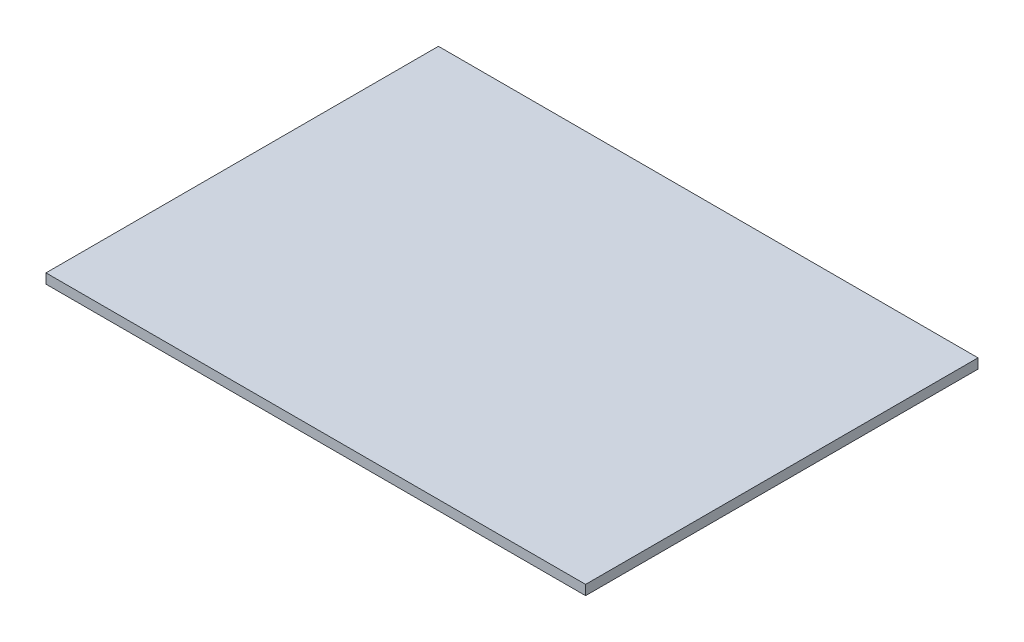
ISO-10303-21;
HEADER;
FILE_DESCRIPTION(('STEP AP214'),'2;1');
FILE_NAME('part.step','',(''),(''),'','','');
FILE_SCHEMA(('AUTOMOTIVE_DESIGN { 1 0 10303 214 1 1 1 1 }'));
ENDSEC;
DATA;
#1=APPLICATION_CONTEXT('core data for automotive mechanical design processes');
#2=APPLICATION_PROTOCOL_DEFINITION('international standard','automotive_design',2000,#1);
#3=PRODUCT_CONTEXT('',#1,'mechanical');
#4=PRODUCT('Part','Part','',(#3));
#5=PRODUCT_RELATED_PRODUCT_CATEGORY('part','',(#4));
#6=PRODUCT_DEFINITION_FORMATION('','',#4);
#7=PRODUCT_DEFINITION_CONTEXT('part definition',#1,'design');
#8=PRODUCT_DEFINITION('design','',#6,#7);
#9=PRODUCT_DEFINITION_SHAPE('','',#8);
#10=(LENGTH_UNIT() NAMED_UNIT(*) SI_UNIT(.MILLI.,.METRE.));
#11=(NAMED_UNIT(*) PLANE_ANGLE_UNIT() SI_UNIT($,.RADIAN.));
#12=(NAMED_UNIT(*) SI_UNIT($,.STERADIAN.) SOLID_ANGLE_UNIT());
#13=UNCERTAINTY_MEASURE_WITH_UNIT(LENGTH_MEASURE(1.E-05),#10,'distance_accuracy_value','');
#14=(GEOMETRIC_REPRESENTATION_CONTEXT(3) GLOBAL_UNCERTAINTY_ASSIGNED_CONTEXT((#13)) GLOBAL_UNIT_ASSIGNED_CONTEXT((#10,
#11,#12)) REPRESENTATION_CONTEXT('',''));
#15=CARTESIAN_POINT('',(0.,0.,0.));
#16=DIRECTION('',(0.,0.,1.));
#17=DIRECTION('',(1.,0.,0.));
#18=AXIS2_PLACEMENT_3D('',#15,#16,#17);
#19=CARTESIAN_POINT('',(0.,100.,0.));
#20=DIRECTION('',(1.,0.,0.));
#21=DIRECTION('',(0.,0.,-1.));
#22=AXIS2_PLACEMENT_3D('',#19,#20,#21);
#23=PLANE('',#22);
#24=DIRECTION('',(0.,0.,1.));
#25=VECTOR('',#24,1.);
#26=CARTESIAN_POINT('',(0.,0.,0.));
#27=LINE('',#26,#25);
#28=CARTESIAN_POINT('',(0.,0.,-4000.));
#29=VERTEX_POINT('',#28);
#30=CARTESIAN_POINT('',(0.,0.,0.));
#31=VERTEX_POINT('',#30);
#32=EDGE_CURVE('E100',#29,#31,#27,.T.);
#33=ORIENTED_EDGE('',*,*,#32,.T.);
#34=DIRECTION('',(0.,-1.,0.));
#35=VECTOR('',#34,1.);
#36=CARTESIAN_POINT('',(0.,100.,0.));
#37=LINE('',#36,#35);
#38=CARTESIAN_POINT('',(0.,100.,0.));
#39=VERTEX_POINT('',#38);
#40=EDGE_CURVE('E11',#39,#31,#37,.T.);
#41=ORIENTED_EDGE('',*,*,#40,.F.);
#42=DIRECTION('',(0.,0.,1.));
#43=VECTOR('',#42,1.);
#44=CARTESIAN_POINT('',(0.,100.,0.));
#45=LINE('',#44,#43);
#46=CARTESIAN_POINT('',(0.,100.,-4000.));
#47=VERTEX_POINT('',#46);
#48=EDGE_CURVE('E88',#47,#39,#45,.T.);
#49=ORIENTED_EDGE('',*,*,#48,.F.);
#50=DIRECTION('',(0.,-1.,0.));
#51=VECTOR('',#50,1.);
#52=CARTESIAN_POINT('',(0.,100.,-4000.));
#53=LINE('',#52,#51);
#54=EDGE_CURVE('E96',#47,#29,#53,.T.);
#55=ORIENTED_EDGE('',*,*,#54,.T.);
#56=EDGE_LOOP('',(#33,#41,#49,#55));
#57=FACE_BOUND('',#56,.T.);
#58=ADVANCED_FACE('F37',(#57),#23,.F.);
#59=CARTESIAN_POINT('',(0.,100.,0.));
#60=DIRECTION('',(0.,0.,-1.));
#61=DIRECTION('',(-1.,0.,0.));
#62=AXIS2_PLACEMENT_3D('',#59,#60,#61);
#63=PLANE('',#62);
#64=DIRECTION('',(1.,0.,0.));
#65=VECTOR('',#64,1.);
#66=CARTESIAN_POINT('',(0.,0.,0.));
#67=LINE('',#66,#65);
#68=CARTESIAN_POINT('',(5500.,0.,0.));
#69=VERTEX_POINT('',#68);
#70=EDGE_CURVE('E92',#31,#69,#67,.T.);
#71=ORIENTED_EDGE('',*,*,#70,.T.);
#72=DIRECTION('',(0.,-1.,0.));
#73=VECTOR('',#72,1.);
#74=CARTESIAN_POINT('',(5500.,100.,0.));
#75=LINE('',#74,#73);
#76=CARTESIAN_POINT('',(5500.,100.,0.));
#77=VERTEX_POINT('',#76);
#78=EDGE_CURVE('E45',#77,#69,#75,.T.);
#79=ORIENTED_EDGE('',*,*,#78,.F.);
#80=DIRECTION('',(1.,0.,0.));
#81=VECTOR('',#80,1.);
#82=CARTESIAN_POINT('',(0.,100.,0.));
#83=LINE('',#82,#81);
#84=EDGE_CURVE('E83',#39,#77,#83,.T.);
#85=ORIENTED_EDGE('',*,*,#84,.F.);
#86=ORIENTED_EDGE('',*,*,#40,.T.);
#87=EDGE_LOOP('',(#71,#79,#85,#86));
#88=FACE_BOUND('',#87,.T.);
#89=ADVANCED_FACE('F91',(#88),#63,.F.);
#90=CARTESIAN_POINT('',(5500.,100.,0.));
#91=DIRECTION('',(-1.,0.,0.));
#92=DIRECTION('',(0.,0.,1.));
#93=AXIS2_PLACEMENT_3D('',#90,#91,#92);
#94=PLANE('',#93);
#95=DIRECTION('',(0.,0.,-1.));
#96=VECTOR('',#95,1.);
#97=CARTESIAN_POINT('',(5500.,0.,0.));
#98=LINE('',#97,#96);
#99=CARTESIAN_POINT('',(5500.,0.,-4000.));
#100=VERTEX_POINT('',#99);
#101=EDGE_CURVE('E70',#69,#100,#98,.T.);
#102=ORIENTED_EDGE('',*,*,#101,.T.);
#103=DIRECTION('',(0.,-1.,0.));
#104=VECTOR('',#103,1.);
#105=CARTESIAN_POINT('',(5500.,100.,-4000.));
#106=LINE('',#105,#104);
#107=CARTESIAN_POINT('',(5500.,100.,-4000.));
#108=VERTEX_POINT('',#107);
#109=EDGE_CURVE('E93',#108,#100,#106,.T.);
#110=ORIENTED_EDGE('',*,*,#109,.F.);
#111=DIRECTION('',(0.,0.,-1.));
#112=VECTOR('',#111,1.);
#113=CARTESIAN_POINT('',(5500.,100.,0.));
#114=LINE('',#113,#112);
#115=EDGE_CURVE('E86',#77,#108,#114,.T.);
#116=ORIENTED_EDGE('',*,*,#115,.F.);
#117=ORIENTED_EDGE('',*,*,#78,.T.);
#118=EDGE_LOOP('',(#102,#110,#116,#117));
#119=FACE_BOUND('',#118,.T.);
#120=ADVANCED_FACE('F94',(#119),#94,.F.);
#121=CARTESIAN_POINT('',(0.,100.,-4000.));
#122=DIRECTION('',(0.,0.,1.));
#123=DIRECTION('',(1.,0.,0.));
#124=AXIS2_PLACEMENT_3D('',#121,#122,#123);
#125=PLANE('',#124);
#126=DIRECTION('',(-1.,0.,0.));
#127=VECTOR('',#126,1.);
#128=CARTESIAN_POINT('',(0.,0.,-4000.));
#129=LINE('',#128,#127);
#130=EDGE_CURVE('E76',#100,#29,#129,.T.);
#131=ORIENTED_EDGE('',*,*,#130,.T.);
#132=ORIENTED_EDGE('',*,*,#54,.F.);
#133=DIRECTION('',(-1.,0.,0.));
#134=VECTOR('',#133,1.);
#135=CARTESIAN_POINT('',(0.,100.,-4000.));
#136=LINE('',#135,#134);
#137=EDGE_CURVE('E53',#108,#47,#136,.T.);
#138=ORIENTED_EDGE('',*,*,#137,.F.);
#139=ORIENTED_EDGE('',*,*,#109,.T.);
#140=EDGE_LOOP('',(#131,#132,#138,#139));
#141=FACE_BOUND('',#140,.T.);
#142=ADVANCED_FACE('F107',(#141),#125,.F.);
#143=CARTESIAN_POINT('',(0.,100.,0.));
#144=DIRECTION('',(0.,-1.,0.));
#145=DIRECTION('',(0.,0.,-1.));
#146=AXIS2_PLACEMENT_3D('',#143,#144,#145);
#147=PLANE('',#146);
#148=ORIENTED_EDGE('',*,*,#48,.T.);
#149=ORIENTED_EDGE('',*,*,#84,.T.);
#150=ORIENTED_EDGE('',*,*,#115,.T.);
#151=ORIENTED_EDGE('',*,*,#137,.T.);
#152=EDGE_LOOP('',(#148,#149,#150,#151));
#153=FACE_BOUND('',#152,.T.);
#154=ADVANCED_FACE('F84',(#153),#147,.F.);
#155=CARTESIAN_POINT('',(0.,0.,0.));
#156=DIRECTION('',(0.,-1.,0.));
#157=DIRECTION('',(0.,0.,-1.));
#158=AXIS2_PLACEMENT_3D('',#155,#156,#157);
#159=PLANE('',#158);
#160=ORIENTED_EDGE('',*,*,#32,.F.);
#161=ORIENTED_EDGE('',*,*,#130,.F.);
#162=ORIENTED_EDGE('',*,*,#101,.F.);
#163=ORIENTED_EDGE('',*,*,#70,.F.);
#164=EDGE_LOOP('',(#160,#161,#162,#163));
#165=FACE_BOUND('',#164,.T.);
#166=ADVANCED_FACE('F110',(#165),#159,.T.);
#167=CLOSED_SHELL('',(#58,#89,#120,#142,#154,#166));
#168=MANIFOLD_SOLID_BREP('B2',#167);
#169=ADVANCED_BREP_SHAPE_REPRESENTATION('',(#18,#168),#14);
#170=SHAPE_DEFINITION_REPRESENTATION(#9,#169);
ENDSEC;
END-ISO-10303-21;
